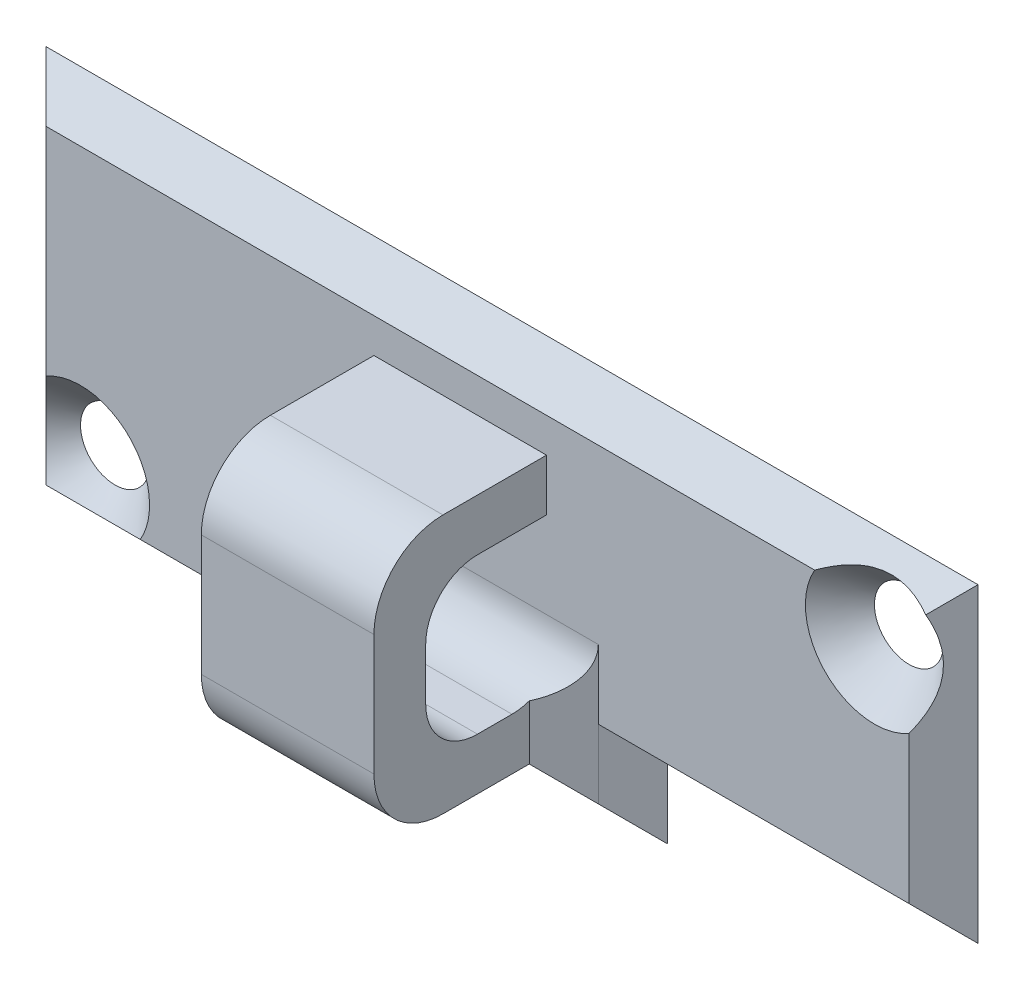
ISO-10303-21;
HEADER;
FILE_DESCRIPTION(('STEP AP214'),'2;1');
FILE_NAME('part.step','',(''),(''),'','','');
FILE_SCHEMA(('AUTOMOTIVE_DESIGN { 1 0 10303 214 1 1 1 1 }'));
ENDSEC;
DATA;
#1=APPLICATION_CONTEXT('core data for automotive mechanical design processes');
#2=APPLICATION_PROTOCOL_DEFINITION('international standard','automotive_design',2000,#1);
#3=PRODUCT_CONTEXT('',#1,'mechanical');
#4=PRODUCT('Part','Part','',(#3));
#5=PRODUCT_RELATED_PRODUCT_CATEGORY('part','',(#4));
#6=PRODUCT_DEFINITION_FORMATION('','',#4);
#7=PRODUCT_DEFINITION_CONTEXT('part definition',#1,'design');
#8=PRODUCT_DEFINITION('design','',#6,#7);
#9=PRODUCT_DEFINITION_SHAPE('','',#8);
#10=(LENGTH_UNIT() NAMED_UNIT(*) SI_UNIT(.MILLI.,.METRE.));
#11=(NAMED_UNIT(*) PLANE_ANGLE_UNIT() SI_UNIT($,.RADIAN.));
#12=(NAMED_UNIT(*) SI_UNIT($,.STERADIAN.) SOLID_ANGLE_UNIT());
#13=UNCERTAINTY_MEASURE_WITH_UNIT(LENGTH_MEASURE(1.E-05),#10,'distance_accuracy_value','');
#14=(GEOMETRIC_REPRESENTATION_CONTEXT(3) GLOBAL_UNCERTAINTY_ASSIGNED_CONTEXT((#13)) GLOBAL_UNIT_ASSIGNED_CONTEXT((#10,
#11,#12)) REPRESENTATION_CONTEXT('',''));
#15=CARTESIAN_POINT('',(0.,0.,0.));
#16=DIRECTION('',(0.,0.,1.));
#17=DIRECTION('',(1.,0.,0.));
#18=AXIS2_PLACEMENT_3D('',#15,#16,#17);
#19=CARTESIAN_POINT('',(0.,0.,1.));
#20=DIRECTION('',(0.,0.,1.));
#21=DIRECTION('',(1.,0.,0.));
#22=AXIS2_PLACEMENT_3D('',#19,#20,#21);
#23=PLANE('',#22);
#24=DIRECTION('',(0.,1.,0.));
#25=VECTOR('',#24,1.);
#26=CARTESIAN_POINT('',(-3.5,-0.5,1.));
#27=LINE('',#26,#25);
#28=CARTESIAN_POINT('',(-3.5,-4.5,1.));
#29=VERTEX_POINT('',#28);
#30=CARTESIAN_POINT('',(-3.5,-0.5,1.));
#31=VERTEX_POINT('',#30);
#32=EDGE_CURVE('E224',#29,#31,#27,.T.);
#33=ORIENTED_EDGE('',*,*,#32,.T.);
#34=DIRECTION('',(1.,0.,0.));
#35=VECTOR('',#34,1.);
#36=CARTESIAN_POINT('',(2.5,-0.5,1.));
#37=LINE('',#36,#35);
#38=CARTESIAN_POINT('',(3.5,-0.5,1.));
#39=VERTEX_POINT('',#38);
#40=EDGE_CURVE('E425',#31,#39,#37,.T.);
#41=ORIENTED_EDGE('',*,*,#40,.T.);
#42=DIRECTION('',(0.,-1.,0.));
#43=VECTOR('',#42,1.);
#44=CARTESIAN_POINT('',(3.5,0.,1.));
#45=LINE('',#44,#43);
#46=CARTESIAN_POINT('',(3.5,-2.5,1.));
#47=VERTEX_POINT('',#46);
#48=EDGE_CURVE('E410',#39,#47,#45,.T.);
#49=ORIENTED_EDGE('',*,*,#48,.T.);
#50=DIRECTION('',(1.,0.,0.));
#51=VECTOR('',#50,1.);
#52=CARTESIAN_POINT('',(13.5,-2.5,1.));
#53=LINE('',#52,#51);
#54=CARTESIAN_POINT('',(12.5,-2.5,1.));
#55=VERTEX_POINT('',#54);
#56=EDGE_CURVE('E412',#47,#55,#53,.T.);
#57=ORIENTED_EDGE('',*,*,#56,.T.);
#58=DIRECTION('',(0.,1.,0.));
#59=VECTOR('',#58,1.);
#60=CARTESIAN_POINT('',(12.5,5.5,1.));
#61=LINE('',#60,#59);
#62=CARTESIAN_POINT('',(12.5,1.76794919243112,1.));
#63=VERTEX_POINT('',#62);
#64=EDGE_CURVE('E414',#55,#63,#61,.T.);
#65=ORIENTED_EDGE('',*,*,#64,.T.);
#66=CARTESIAN_POINT('',(11.5,3.5,1.));
#67=DIRECTION('',(0.,0.,1.));
#68=DIRECTION('',(1.,0.,0.));
#69=AXIS2_PLACEMENT_3D('',#66,#67,#68);
#70=CIRCLE('',#69,2.);
#71=CARTESIAN_POINT('',(9.76794919243112,4.5,1.));
#72=VERTEX_POINT('',#71);
#73=EDGE_CURVE('E416',#63,#72,#70,.F.);
#74=ORIENTED_EDGE('',*,*,#73,.T.);
#75=DIRECTION('',(-1.,0.,0.));
#76=VECTOR('',#75,1.);
#77=CARTESIAN_POINT('',(0.,4.5,1.));
#78=LINE('',#77,#76);
#79=CARTESIAN_POINT('',(-12.5,4.5,1.));
#80=VERTEX_POINT('',#79);
#81=EDGE_CURVE('E418',#72,#80,#78,.T.);
#82=ORIENTED_EDGE('',*,*,#81,.T.);
#83=DIRECTION('',(0.,-1.,0.));
#84=VECTOR('',#83,1.);
#85=CARTESIAN_POINT('',(-12.5,0.,1.));
#86=LINE('',#85,#84);
#87=CARTESIAN_POINT('',(-12.5,-1.76794919243112,1.));
#88=VERTEX_POINT('',#87);
#89=EDGE_CURVE('E420',#80,#88,#86,.T.);
#90=ORIENTED_EDGE('',*,*,#89,.T.);
#91=CARTESIAN_POINT('',(-11.5,-3.5,1.));
#92=DIRECTION('',(0.,0.,1.));
#93=DIRECTION('',(1.,0.,0.));
#94=AXIS2_PLACEMENT_3D('',#91,#92,#93);
#95=CIRCLE('',#94,2.);
#96=CARTESIAN_POINT('',(-9.76794919243112,-4.5,1.));
#97=VERTEX_POINT('',#96);
#98=EDGE_CURVE('E422',#88,#97,#95,.F.);
#99=ORIENTED_EDGE('',*,*,#98,.T.);
#100=DIRECTION('',(1.,0.,0.));
#101=VECTOR('',#100,1.);
#102=CARTESIAN_POINT('',(4.5,-4.5,1.));
#103=LINE('',#102,#101);
#104=EDGE_CURVE('E424',#97,#29,#103,.T.);
#105=ORIENTED_EDGE('',*,*,#104,.T.);
#106=EDGE_LOOP('',(#33,#41,#49,#57,#65,#74,#82,#90,#99,#105));
#107=FACE_BOUND('',#106,.T.);
#108=ADVANCED_FACE('F41',(#107),#23,.T.);
#109=CARTESIAN_POINT('',(0.,0.,0.));
#110=DIRECTION('',(0.,0.,1.));
#111=DIRECTION('',(1.,0.,0.));
#112=AXIS2_PLACEMENT_3D('',#109,#110,#111);
#113=PLANE('',#112);
#114=CARTESIAN_POINT('',(11.5,3.5,0.));
#115=DIRECTION('',(0.,0.,1.));
#116=DIRECTION('',(1.,0.,0.));
#117=AXIS2_PLACEMENT_3D('',#114,#115,#116);
#118=CIRCLE('',#117,1.);
#119=CARTESIAN_POINT('',(12.5,3.5,0.));
#120=VERTEX_POINT('',#119);
#121=EDGE_CURVE('E472',#120,#120,#118,.T.);
#122=ORIENTED_EDGE('',*,*,#121,.T.);
#123=EDGE_LOOP('',(#122));
#124=FACE_BOUND('',#123,.T.);
#125=CARTESIAN_POINT('',(-11.5,-3.5,0.));
#126=DIRECTION('',(0.,0.,1.));
#127=DIRECTION('',(1.,0.,0.));
#128=AXIS2_PLACEMENT_3D('',#125,#126,#127);
#129=CIRCLE('',#128,1.);
#130=CARTESIAN_POINT('',(-10.5,-3.5,0.));
#131=VERTEX_POINT('',#130);
#132=EDGE_CURVE('E476',#131,#131,#129,.T.);
#133=ORIENTED_EDGE('',*,*,#132,.T.);
#134=EDGE_LOOP('',(#133));
#135=FACE_BOUND('',#134,.T.);
#136=DIRECTION('',(0.,-1.,0.));
#137=VECTOR('',#136,1.);
#138=CARTESIAN_POINT('',(4.5,0.,0.));
#139=LINE('',#138,#137);
#140=CARTESIAN_POINT('',(4.5,-3.5,0.));
#141=VERTEX_POINT('',#140);
#142=CARTESIAN_POINT('',(4.5,-5.5,0.));
#143=VERTEX_POINT('',#142);
#144=EDGE_CURVE('E479',#141,#143,#139,.T.);
#145=ORIENTED_EDGE('',*,*,#144,.T.);
#146=DIRECTION('',(1.,0.,0.));
#147=VECTOR('',#146,1.);
#148=CARTESIAN_POINT('',(0.,-5.5,0.));
#149=LINE('',#148,#147);
#150=CARTESIAN_POINT('',(-13.5,-5.5,0.));
#151=VERTEX_POINT('',#150);
#152=EDGE_CURVE('E491',#151,#143,#149,.T.);
#153=ORIENTED_EDGE('',*,*,#152,.F.);
#154=DIRECTION('',(0.,1.,0.));
#155=VECTOR('',#154,1.);
#156=CARTESIAN_POINT('',(-13.5,0.,0.));
#157=LINE('',#156,#155);
#158=CARTESIAN_POINT('',(-13.5,5.5,0.));
#159=VERTEX_POINT('',#158);
#160=EDGE_CURVE('E489',#151,#159,#157,.T.);
#161=ORIENTED_EDGE('',*,*,#160,.T.);
#162=DIRECTION('',(1.,0.,0.));
#163=VECTOR('',#162,1.);
#164=CARTESIAN_POINT('',(0.,5.5,0.));
#165=LINE('',#164,#163);
#166=CARTESIAN_POINT('',(13.5,5.5,0.));
#167=VERTEX_POINT('',#166);
#168=EDGE_CURVE('E487',#159,#167,#165,.T.);
#169=ORIENTED_EDGE('',*,*,#168,.T.);
#170=DIRECTION('',(0.,1.,0.));
#171=VECTOR('',#170,1.);
#172=CARTESIAN_POINT('',(13.5,0.,0.));
#173=LINE('',#172,#171);
#174=CARTESIAN_POINT('',(13.5,-3.5,0.));
#175=VERTEX_POINT('',#174);
#176=EDGE_CURVE('E484',#175,#167,#173,.T.);
#177=ORIENTED_EDGE('',*,*,#176,.F.);
#178=DIRECTION('',(1.,0.,0.));
#179=VECTOR('',#178,1.);
#180=CARTESIAN_POINT('',(0.,-3.5,0.));
#181=LINE('',#180,#179);
#182=EDGE_CURVE('E481',#141,#175,#181,.T.);
#183=ORIENTED_EDGE('',*,*,#182,.F.);
#184=EDGE_LOOP('',(#145,#153,#161,#169,#177,#183));
#185=FACE_BOUND('',#184,.T.);
#186=ADVANCED_FACE('F364',(#124,#135,#185),#113,.F.);
#187=CARTESIAN_POINT('',(-2.5,-3.5,1.));
#188=DIRECTION('',(0.,-1.,0.));
#189=DIRECTION('',(0.,0.,-1.));
#190=AXIS2_PLACEMENT_3D('',#187,#188,#189);
#191=PLANE('',#190);
#192=DIRECTION('',(0.,0.,-1.));
#193=VECTOR('',#192,1.);
#194=CARTESIAN_POINT('',(-2.5,-3.5,1.));
#195=LINE('',#194,#193);
#196=CARTESIAN_POINT('',(-2.5,-3.5,4.5));
#197=VERTEX_POINT('',#196);
#198=CARTESIAN_POINT('',(-2.5,-3.5,2.00000000000001));
#199=VERTEX_POINT('',#198);
#200=EDGE_CURVE('E215',#197,#199,#195,.T.);
#201=ORIENTED_EDGE('',*,*,#200,.T.);
#202=DIRECTION('',(1.,0.,0.));
#203=VECTOR('',#202,1.);
#204=CARTESIAN_POINT('',(2.5,-3.5,2.00000000000001));
#205=LINE('',#204,#203);
#206=CARTESIAN_POINT('',(2.5,-3.5,2.00000000000001));
#207=VERTEX_POINT('',#206);
#208=EDGE_CURVE('E223',#199,#207,#205,.T.);
#209=ORIENTED_EDGE('',*,*,#208,.T.);
#210=DIRECTION('',(0.,0.,-1.));
#211=VECTOR('',#210,1.);
#212=CARTESIAN_POINT('',(2.5,-3.5,1.));
#213=LINE('',#212,#211);
#214=CARTESIAN_POINT('',(2.5,-3.5,4.5));
#215=VERTEX_POINT('',#214);
#216=EDGE_CURVE('E461',#215,#207,#213,.T.);
#217=ORIENTED_EDGE('',*,*,#216,.F.);
#218=DIRECTION('',(1.,0.,0.));
#219=VECTOR('',#218,1.);
#220=CARTESIAN_POINT('',(-2.5,-3.5,4.5));
#221=LINE('',#220,#219);
#222=EDGE_CURVE('E231',#215,#197,#221,.F.);
#223=ORIENTED_EDGE('',*,*,#222,.T.);
#224=EDGE_LOOP('',(#201,#209,#217,#223));
#225=FACE_BOUND('',#224,.T.);
#226=ADVANCED_FACE('F227',(#225),#191,.T.);
#227=CARTESIAN_POINT('',(-2.5,-3.5,6.5));
#228=DIRECTION('',(0.,0.,1.));
#229=DIRECTION('',(1.,0.,0.));
#230=AXIS2_PLACEMENT_3D('',#227,#228,#229);
#231=PLANE('',#230);
#232=DIRECTION('',(0.,-1.,0.));
#233=VECTOR('',#232,1.);
#234=CARTESIAN_POINT('',(2.5,-3.5,6.5));
#235=LINE('',#234,#233);
#236=CARTESIAN_POINT('',(2.5,2.,6.5));
#237=VERTEX_POINT('',#236);
#238=CARTESIAN_POINT('',(2.5,-1.5,6.5));
#239=VERTEX_POINT('',#238);
#240=EDGE_CURVE('E458',#237,#239,#235,.T.);
#241=ORIENTED_EDGE('',*,*,#240,.F.);
#242=DIRECTION('',(1.,0.,0.));
#243=VECTOR('',#242,1.);
#244=CARTESIAN_POINT('',(-2.5,2.,6.5));
#245=LINE('',#244,#243);
#246=CARTESIAN_POINT('',(-2.5,2.,6.5));
#247=VERTEX_POINT('',#246);
#248=EDGE_CURVE('E403',#237,#247,#245,.F.);
#249=ORIENTED_EDGE('',*,*,#248,.T.);
#250=DIRECTION('',(0.,-1.,0.));
#251=VECTOR('',#250,1.);
#252=CARTESIAN_POINT('',(-2.5,-3.5,6.5));
#253=LINE('',#252,#251);
#254=CARTESIAN_POINT('',(-2.5,-1.5,6.5));
#255=VERTEX_POINT('',#254);
#256=EDGE_CURVE('E233',#247,#255,#253,.T.);
#257=ORIENTED_EDGE('',*,*,#256,.T.);
#258=DIRECTION('',(1.,0.,0.));
#259=VECTOR('',#258,1.);
#260=CARTESIAN_POINT('',(-2.5,-1.5,6.5));
#261=LINE('',#260,#259);
#262=EDGE_CURVE('E399',#255,#239,#261,.T.);
#263=ORIENTED_EDGE('',*,*,#262,.T.);
#264=EDGE_LOOP('',(#241,#249,#257,#263));
#265=FACE_BOUND('',#264,.T.);
#266=ADVANCED_FACE('F457',(#265),#231,.T.);
#267=CARTESIAN_POINT('',(-2.5,4.,1.5));
#268=DIRECTION('',(0.,1.,0.));
#269=DIRECTION('',(0.,0.,1.));
#270=AXIS2_PLACEMENT_3D('',#267,#268,#269);
#271=PLANE('',#270);
#272=DIRECTION('',(0.,0.,1.));
#273=VECTOR('',#272,1.);
#274=CARTESIAN_POINT('',(-2.5,4.,1.5));
#275=LINE('',#274,#273);
#276=CARTESIAN_POINT('',(-2.5,4.,1.5));
#277=VERTEX_POINT('',#276);
#278=CARTESIAN_POINT('',(-2.5,4.,4.5));
#279=VERTEX_POINT('',#278);
#280=EDGE_CURVE('E519',#277,#279,#275,.T.);
#281=ORIENTED_EDGE('',*,*,#280,.T.);
#282=DIRECTION('',(1.,0.,0.));
#283=VECTOR('',#282,1.);
#284=CARTESIAN_POINT('',(-2.5,4.,4.5));
#285=LINE('',#284,#283);
#286=CARTESIAN_POINT('',(2.5,4.,4.5));
#287=VERTEX_POINT('',#286);
#288=EDGE_CURVE('E448',#279,#287,#285,.T.);
#289=ORIENTED_EDGE('',*,*,#288,.T.);
#290=DIRECTION('',(0.,0.,1.));
#291=VECTOR('',#290,1.);
#292=CARTESIAN_POINT('',(2.5,4.,1.5));
#293=LINE('',#292,#291);
#294=CARTESIAN_POINT('',(2.5,4.,1.5));
#295=VERTEX_POINT('',#294);
#296=EDGE_CURVE('E462',#295,#287,#293,.T.);
#297=ORIENTED_EDGE('',*,*,#296,.F.);
#298=DIRECTION('',(1.,0.,0.));
#299=VECTOR('',#298,1.);
#300=CARTESIAN_POINT('',(-2.5,4.,1.5));
#301=LINE('',#300,#299);
#302=EDGE_CURVE('E470',#277,#295,#301,.T.);
#303=ORIENTED_EDGE('',*,*,#302,.F.);
#304=EDGE_LOOP('',(#281,#289,#297,#303));
#305=FACE_BOUND('',#304,.T.);
#306=ADVANCED_FACE('F536',(#305),#271,.T.);
#307=CARTESIAN_POINT('',(-2.5,2.5,1.5));
#308=DIRECTION('',(0.,0.,-1.));
#309=DIRECTION('',(-1.,0.,0.));
#310=AXIS2_PLACEMENT_3D('',#307,#308,#309);
#311=PLANE('',#310);
#312=DIRECTION('',(0.,1.,0.));
#313=VECTOR('',#312,1.);
#314=CARTESIAN_POINT('',(2.5,2.5,1.5));
#315=LINE('',#314,#313);
#316=CARTESIAN_POINT('',(2.5,2.5,1.5));
#317=VERTEX_POINT('',#316);
#318=EDGE_CURVE('E466',#317,#295,#315,.T.);
#319=ORIENTED_EDGE('',*,*,#318,.F.);
#320=DIRECTION('',(1.,0.,0.));
#321=VECTOR('',#320,1.);
#322=CARTESIAN_POINT('',(-2.5,2.5,1.5));
#323=LINE('',#322,#321);
#324=CARTESIAN_POINT('',(-2.5,2.5,1.5));
#325=VERTEX_POINT('',#324);
#326=EDGE_CURVE('E232',#325,#317,#323,.T.);
#327=ORIENTED_EDGE('',*,*,#326,.F.);
#328=DIRECTION('',(0.,1.,0.));
#329=VECTOR('',#328,1.);
#330=CARTESIAN_POINT('',(-2.5,2.5,1.5));
#331=LINE('',#330,#329);
#332=EDGE_CURVE('E516',#325,#277,#331,.T.);
#333=ORIENTED_EDGE('',*,*,#332,.T.);
#334=ORIENTED_EDGE('',*,*,#302,.T.);
#335=EDGE_LOOP('',(#319,#327,#333,#334));
#336=FACE_BOUND('',#335,.T.);
#337=ADVANCED_FACE('F531',(#336),#311,.T.);
#338=CARTESIAN_POINT('',(-2.5,2.5,5.));
#339=DIRECTION('',(0.,-1.,0.));
#340=DIRECTION('',(0.,0.,-1.));
#341=AXIS2_PLACEMENT_3D('',#338,#339,#340);
#342=PLANE('',#341);
#343=DIRECTION('',(0.,0.,-1.));
#344=VECTOR('',#343,1.);
#345=CARTESIAN_POINT('',(2.5,2.5,5.));
#346=LINE('',#345,#344);
#347=CARTESIAN_POINT('',(2.5,2.5,3.5));
#348=VERTEX_POINT('',#347);
#349=EDGE_CURVE('E96',#348,#317,#346,.T.);
#350=ORIENTED_EDGE('',*,*,#349,.F.);
#351=DIRECTION('',(1.,0.,0.));
#352=VECTOR('',#351,1.);
#353=CARTESIAN_POINT('',(-2.5,2.5,3.5));
#354=LINE('',#353,#352);
#355=CARTESIAN_POINT('',(-2.5,2.5,3.5));
#356=VERTEX_POINT('',#355);
#357=EDGE_CURVE('E499',#348,#356,#354,.F.);
#358=ORIENTED_EDGE('',*,*,#357,.T.);
#359=DIRECTION('',(0.,0.,-1.));
#360=VECTOR('',#359,1.);
#361=CARTESIAN_POINT('',(-2.5,2.5,5.));
#362=LINE('',#361,#360);
#363=EDGE_CURVE('E511',#356,#325,#362,.T.);
#364=ORIENTED_EDGE('',*,*,#363,.T.);
#365=ORIENTED_EDGE('',*,*,#326,.T.);
#366=EDGE_LOOP('',(#350,#358,#364,#365));
#367=FACE_BOUND('',#366,.T.);
#368=ADVANCED_FACE('F541',(#367),#342,.T.);
#369=CARTESIAN_POINT('',(-2.5,-2.,5.));
#370=DIRECTION('',(0.,0.,-1.));
#371=DIRECTION('',(-1.,0.,0.));
#372=AXIS2_PLACEMENT_3D('',#369,#370,#371);
#373=PLANE('',#372);
#374=DIRECTION('',(0.,1.,0.));
#375=VECTOR('',#374,1.);
#376=CARTESIAN_POINT('',(-2.5,-2.,5.));
#377=LINE('',#376,#375);
#378=CARTESIAN_POINT('',(-2.5,-0.5,5.));
#379=VERTEX_POINT('',#378);
#380=CARTESIAN_POINT('',(-2.5,1.,5.));
#381=VERTEX_POINT('',#380);
#382=EDGE_CURVE('E508',#379,#381,#377,.T.);
#383=ORIENTED_EDGE('',*,*,#382,.T.);
#384=DIRECTION('',(1.,0.,0.));
#385=VECTOR('',#384,1.);
#386=CARTESIAN_POINT('',(2.5,1.,5.));
#387=LINE('',#386,#385);
#388=CARTESIAN_POINT('',(2.5,1.,5.));
#389=VERTEX_POINT('',#388);
#390=EDGE_CURVE('E496',#381,#389,#387,.T.);
#391=ORIENTED_EDGE('',*,*,#390,.T.);
#392=DIRECTION('',(0.,1.,0.));
#393=VECTOR('',#392,1.);
#394=CARTESIAN_POINT('',(2.5,-2.,5.));
#395=LINE('',#394,#393);
#396=CARTESIAN_POINT('',(2.5,-0.5,5.));
#397=VERTEX_POINT('',#396);
#398=EDGE_CURVE('E524',#397,#389,#395,.T.);
#399=ORIENTED_EDGE('',*,*,#398,.F.);
#400=DIRECTION('',(1.,0.,0.));
#401=VECTOR('',#400,1.);
#402=CARTESIAN_POINT('',(-2.5,-0.5,5.));
#403=LINE('',#402,#401);
#404=EDGE_CURVE('E494',#397,#379,#403,.F.);
#405=ORIENTED_EDGE('',*,*,#404,.T.);
#406=EDGE_LOOP('',(#383,#391,#399,#405));
#407=FACE_BOUND('',#406,.T.);
#408=ADVANCED_FACE('F547',(#407),#373,.T.);
#409=CARTESIAN_POINT('',(-2.5,-2.,1.));
#410=DIRECTION('',(0.,1.,0.));
#411=DIRECTION('',(0.,0.,1.));
#412=AXIS2_PLACEMENT_3D('',#409,#410,#411);
#413=PLANE('',#412);
#414=DIRECTION('',(0.,0.,1.));
#415=VECTOR('',#414,1.);
#416=CARTESIAN_POINT('',(-2.5,-2.,1.));
#417=LINE('',#416,#415);
#418=CARTESIAN_POINT('',(-2.5,-2.,2.5));
#419=VERTEX_POINT('',#418);
#420=CARTESIAN_POINT('',(-2.5,-2.,3.5));
#421=VERTEX_POINT('',#420);
#422=EDGE_CURVE('E464',#419,#421,#417,.T.);
#423=ORIENTED_EDGE('',*,*,#422,.T.);
#424=DIRECTION('',(1.,0.,0.));
#425=VECTOR('',#424,1.);
#426=CARTESIAN_POINT('',(2.5,-2.,3.5));
#427=LINE('',#426,#425);
#428=CARTESIAN_POINT('',(2.5,-2.,3.5));
#429=VERTEX_POINT('',#428);
#430=EDGE_CURVE('E431',#421,#429,#427,.T.);
#431=ORIENTED_EDGE('',*,*,#430,.T.);
#432=DIRECTION('',(0.,0.,1.));
#433=VECTOR('',#432,1.);
#434=CARTESIAN_POINT('',(2.5,-2.,1.));
#435=LINE('',#434,#433);
#436=CARTESIAN_POINT('',(2.5,-2.,2.5));
#437=VERTEX_POINT('',#436);
#438=EDGE_CURVE('E505',#437,#429,#435,.T.);
#439=ORIENTED_EDGE('',*,*,#438,.F.);
#440=DIRECTION('',(1.,0.,0.));
#441=VECTOR('',#440,1.);
#442=CARTESIAN_POINT('',(-2.5,-2.,2.5));
#443=LINE('',#442,#441);
#444=EDGE_CURVE('E436',#437,#419,#443,.F.);
#445=ORIENTED_EDGE('',*,*,#444,.T.);
#446=EDGE_LOOP('',(#423,#431,#439,#445));
#447=FACE_BOUND('',#446,.T.);
#448=ADVANCED_FACE('F373',(#447),#413,.T.);
#449=CARTESIAN_POINT('',(-2.5,0.,0.));
#450=DIRECTION('',(-1.,0.,0.));
#451=DIRECTION('',(0.,0.,1.));
#452=AXIS2_PLACEMENT_3D('',#449,#450,#451);
#453=PLANE('',#452);
#454=CARTESIAN_POINT('',(-2.5,-0.5,2.5));
#455=DIRECTION('',(-1.,0.,0.));
#456=DIRECTION('',(0.,0.,1.));
#457=AXIS2_PLACEMENT_3D('',#454,#455,#456);
#458=CIRCLE('',#457,1.5);
#459=CARTESIAN_POINT('',(-2.5,-1.9142135623731,2.00000000000001));
#460=VERTEX_POINT('',#459);
#461=EDGE_CURVE('E219',#419,#460,#458,.F.);
#462=ORIENTED_EDGE('',*,*,#461,.T.);
#463=DIRECTION('',(0.,-1.,0.));
#464=VECTOR('',#463,1.);
#465=CARTESIAN_POINT('',(-2.5,-3.5,2.00000000000001));
#466=LINE('',#465,#464);
#467=EDGE_CURVE('E212',#460,#199,#466,.T.);
#468=ORIENTED_EDGE('',*,*,#467,.T.);
#469=ORIENTED_EDGE('',*,*,#200,.F.);
#470=CARTESIAN_POINT('',(-2.5,-1.5,4.5));
#471=DIRECTION('',(-1.,0.,0.));
#472=DIRECTION('',(0.,0.,1.));
#473=AXIS2_PLACEMENT_3D('',#470,#471,#472);
#474=CIRCLE('',#473,2.);
#475=EDGE_CURVE('E397',#197,#255,#474,.T.);
#476=ORIENTED_EDGE('',*,*,#475,.T.);
#477=ORIENTED_EDGE('',*,*,#256,.F.);
#478=CARTESIAN_POINT('',(-2.5,2.,4.5));
#479=DIRECTION('',(-1.,0.,0.));
#480=DIRECTION('',(0.,0.,1.));
#481=AXIS2_PLACEMENT_3D('',#478,#479,#480);
#482=CIRCLE('',#481,2.);
#483=EDGE_CURVE('E402',#247,#279,#482,.T.);
#484=ORIENTED_EDGE('',*,*,#483,.T.);
#485=ORIENTED_EDGE('',*,*,#280,.F.);
#486=ORIENTED_EDGE('',*,*,#332,.F.);
#487=ORIENTED_EDGE('',*,*,#363,.F.);
#488=CARTESIAN_POINT('',(-2.5,1.,3.5));
#489=DIRECTION('',(-1.,0.,0.));
#490=DIRECTION('',(0.,0.,1.));
#491=AXIS2_PLACEMENT_3D('',#488,#489,#490);
#492=CIRCLE('',#491,1.5);
#493=EDGE_CURVE('E433',#356,#381,#492,.F.);
#494=ORIENTED_EDGE('',*,*,#493,.T.);
#495=ORIENTED_EDGE('',*,*,#382,.F.);
#496=CARTESIAN_POINT('',(-2.5,-0.5,3.5));
#497=DIRECTION('',(-1.,0.,0.));
#498=DIRECTION('',(0.,0.,1.));
#499=AXIS2_PLACEMENT_3D('',#496,#497,#498);
#500=CIRCLE('',#499,1.5);
#501=EDGE_CURVE('E443',#379,#421,#500,.F.);
#502=ORIENTED_EDGE('',*,*,#501,.T.);
#503=ORIENTED_EDGE('',*,*,#422,.F.);
#504=EDGE_LOOP('',(#462,#468,#469,#476,#477,#484,#485,#486,#487,#494,#495,#502,#503));
#505=FACE_BOUND('',#504,.T.);
#506=ADVANCED_FACE('F214',(#505),#453,.T.);
#507=CARTESIAN_POINT('',(2.5,0.,0.));
#508=DIRECTION('',(-1.,0.,0.));
#509=DIRECTION('',(0.,0.,1.));
#510=AXIS2_PLACEMENT_3D('',#507,#508,#509);
#511=PLANE('',#510);
#512=ORIENTED_EDGE('',*,*,#216,.T.);
#513=DIRECTION('',(0.,1.,0.));
#514=VECTOR('',#513,1.);
#515=CARTESIAN_POINT('',(2.5,0.,2.00000000000001));
#516=LINE('',#515,#514);
#517=CARTESIAN_POINT('',(2.5,-1.9142135623731,2.00000000000001));
#518=VERTEX_POINT('',#517);
#519=EDGE_CURVE('E66',#207,#518,#516,.T.);
#520=ORIENTED_EDGE('',*,*,#519,.T.);
#521=CARTESIAN_POINT('',(2.5,-0.5,2.5));
#522=DIRECTION('',(-1.,0.,0.));
#523=DIRECTION('',(0.,0.,1.));
#524=AXIS2_PLACEMENT_3D('',#521,#522,#523);
#525=CIRCLE('',#524,1.5);
#526=EDGE_CURVE('E445',#518,#437,#525,.T.);
#527=ORIENTED_EDGE('',*,*,#526,.T.);
#528=ORIENTED_EDGE('',*,*,#438,.T.);
#529=CARTESIAN_POINT('',(2.5,-0.5,3.5));
#530=DIRECTION('',(-1.,0.,0.));
#531=DIRECTION('',(0.,0.,1.));
#532=AXIS2_PLACEMENT_3D('',#529,#530,#531);
#533=CIRCLE('',#532,1.5);
#534=EDGE_CURVE('E441',#429,#397,#533,.T.);
#535=ORIENTED_EDGE('',*,*,#534,.T.);
#536=ORIENTED_EDGE('',*,*,#398,.T.);
#537=CARTESIAN_POINT('',(2.5,1.,3.5));
#538=DIRECTION('',(-1.,0.,0.));
#539=DIRECTION('',(0.,0.,1.));
#540=AXIS2_PLACEMENT_3D('',#537,#538,#539);
#541=CIRCLE('',#540,1.5);
#542=EDGE_CURVE('E430',#389,#348,#541,.T.);
#543=ORIENTED_EDGE('',*,*,#542,.T.);
#544=ORIENTED_EDGE('',*,*,#349,.T.);
#545=ORIENTED_EDGE('',*,*,#318,.T.);
#546=ORIENTED_EDGE('',*,*,#296,.T.);
#547=CARTESIAN_POINT('',(2.5,2.,4.5));
#548=DIRECTION('',(-1.,0.,0.));
#549=DIRECTION('',(0.,0.,1.));
#550=AXIS2_PLACEMENT_3D('',#547,#548,#549);
#551=CIRCLE('',#550,2.);
#552=EDGE_CURVE('E453',#287,#237,#551,.F.);
#553=ORIENTED_EDGE('',*,*,#552,.T.);
#554=ORIENTED_EDGE('',*,*,#240,.T.);
#555=CARTESIAN_POINT('',(2.5,-1.5,4.5));
#556=DIRECTION('',(-1.,0.,0.));
#557=DIRECTION('',(0.,0.,1.));
#558=AXIS2_PLACEMENT_3D('',#555,#556,#557);
#559=CIRCLE('',#558,2.);
#560=EDGE_CURVE('E451',#239,#215,#559,.F.);
#561=ORIENTED_EDGE('',*,*,#560,.T.);
#562=EDGE_LOOP('',(#512,#520,#527,#528,#535,#536,#543,#544,#545,#546,#553,#554,#561));
#563=FACE_BOUND('',#562,.T.);
#564=ADVANCED_FACE('F380',(#563),#511,.F.);
#565=CARTESIAN_POINT('',(-2.5,1.,3.5));
#566=DIRECTION('',(-1.,0.,0.));
#567=DIRECTION('',(0.,0.,1.));
#568=AXIS2_PLACEMENT_3D('',#565,#566,#567);
#569=CYLINDRICAL_SURFACE('',#568,1.5);
#570=ORIENTED_EDGE('',*,*,#493,.F.);
#571=ORIENTED_EDGE('',*,*,#357,.F.);
#572=ORIENTED_EDGE('',*,*,#542,.F.);
#573=ORIENTED_EDGE('',*,*,#390,.F.);
#574=EDGE_LOOP('',(#570,#571,#572,#573));
#575=FACE_BOUND('',#574,.T.);
#576=ADVANCED_FACE('F376',(#575),#569,.F.);
#577=CARTESIAN_POINT('',(-2.5,-0.5,3.5));
#578=DIRECTION('',(-1.,0.,0.));
#579=DIRECTION('',(0.,0.,1.));
#580=AXIS2_PLACEMENT_3D('',#577,#578,#579);
#581=CYLINDRICAL_SURFACE('',#580,1.5);
#582=ORIENTED_EDGE('',*,*,#501,.F.);
#583=ORIENTED_EDGE('',*,*,#404,.F.);
#584=ORIENTED_EDGE('',*,*,#534,.F.);
#585=ORIENTED_EDGE('',*,*,#430,.F.);
#586=EDGE_LOOP('',(#582,#583,#584,#585));
#587=FACE_BOUND('',#586,.T.);
#588=ADVANCED_FACE('F379',(#587),#581,.F.);
#589=CARTESIAN_POINT('',(0.,-0.5,2.5));
#590=DIRECTION('',(-1.,0.,0.));
#591=DIRECTION('',(0.,0.,1.));
#592=AXIS2_PLACEMENT_3D('',#589,#590,#591);
#593=CYLINDRICAL_SURFACE('',#592,1.5);
#594=ORIENTED_EDGE('',*,*,#461,.F.);
#595=ORIENTED_EDGE('',*,*,#444,.F.);
#596=ORIENTED_EDGE('',*,*,#526,.F.);
#597=CARTESIAN_POINT('',(2.00000000000002,-0.5,2.5));
#598=DIRECTION('',(-0.707106781186551,0.,-0.707106781186544));
#599=DIRECTION('',(-0.707106781186544,0.,0.707106781186551));
#600=AXIS2_PLACEMENT_3D('',#597,#598,#599);
#601=ELLIPSE('',#600,2.12132034355963,1.5);
#602=EDGE_CURVE('E12',#518,#39,#601,.F.);
#603=ORIENTED_EDGE('',*,*,#602,.T.);
#604=ORIENTED_EDGE('',*,*,#40,.F.);
#605=CARTESIAN_POINT('',(-2.00000000000002,-0.5,2.5));
#606=DIRECTION('',(-0.707106781186551,0.,0.707106781186544));
#607=DIRECTION('',(-0.707106781186544,0.,-0.707106781186551));
#608=AXIS2_PLACEMENT_3D('',#605,#606,#607);
#609=ELLIPSE('',#608,2.12132034355963,1.5);
#610=EDGE_CURVE('E57',#31,#460,#609,.T.);
#611=ORIENTED_EDGE('',*,*,#610,.T.);
#612=EDGE_LOOP('',(#594,#595,#596,#603,#604,#611));
#613=FACE_BOUND('',#612,.T.);
#614=ADVANCED_FACE('F384',(#613),#593,.F.);
#615=CARTESIAN_POINT('',(-2.5,2.,4.5));
#616=DIRECTION('',(1.,0.,0.));
#617=DIRECTION('',(0.,0.,-1.));
#618=AXIS2_PLACEMENT_3D('',#615,#616,#617);
#619=CYLINDRICAL_SURFACE('',#618,2.);
#620=ORIENTED_EDGE('',*,*,#483,.F.);
#621=ORIENTED_EDGE('',*,*,#248,.F.);
#622=ORIENTED_EDGE('',*,*,#552,.F.);
#623=ORIENTED_EDGE('',*,*,#288,.F.);
#624=EDGE_LOOP('',(#620,#621,#622,#623));
#625=FACE_BOUND('',#624,.T.);
#626=ADVANCED_FACE('F388',(#625),#619,.T.);
#627=CARTESIAN_POINT('',(-2.5,-1.5,4.5));
#628=DIRECTION('',(1.,0.,0.));
#629=DIRECTION('',(0.,0.,-1.));
#630=AXIS2_PLACEMENT_3D('',#627,#628,#629);
#631=CYLINDRICAL_SURFACE('',#630,2.);
#632=ORIENTED_EDGE('',*,*,#475,.F.);
#633=ORIENTED_EDGE('',*,*,#222,.F.);
#634=ORIENTED_EDGE('',*,*,#560,.F.);
#635=ORIENTED_EDGE('',*,*,#262,.F.);
#636=EDGE_LOOP('',(#632,#633,#634,#635));
#637=FACE_BOUND('',#636,.T.);
#638=ADVANCED_FACE('F342',(#637),#631,.T.);
#639=CARTESIAN_POINT('',(11.5,3.5,0.));
#640=DIRECTION('',(0.,0.,1.));
#641=DIRECTION('',(1.,0.,0.));
#642=AXIS2_PLACEMENT_3D('',#639,#640,#641);
#643=CONICAL_SURFACE('',#642,1.,0.78539816339745);
#644=ORIENTED_EDGE('',*,*,#121,.F.);
#645=EDGE_LOOP('',(#644));
#646=FACE_BOUND('',#645,.T.);
#647=CARTESIAN_POINT('',(9.7676028169037,4.4998,1.0002));
#648=CARTESIAN_POINT('',(9.80575931725496,4.52183239683999,0.978167603160007));
#649=CARTESIAN_POINT('',(9.84441657928379,4.54342936479459,0.956570635205409));
#650=CARTESIAN_POINT('',(9.92276471209283,4.58564423485238,0.914355765147619));
#651=CARTESIAN_POINT('',(9.96245523791513,4.60626245738314,0.893737542616855));
#652=CARTESIAN_POINT('',(10.0835252284365,4.6666889917118,0.833311008288192));
#653=CARTESIAN_POINT('',(10.1665605672992,4.70486902755063,0.795130972449365));
#654=CARTESIAN_POINT('',(10.3383118597862,4.77632595187072,0.723674048129274));
#655=CARTESIAN_POINT('',(10.4270898813901,4.80952880043666,0.690471199563333));
#656=CARTESIAN_POINT('',(10.6091572357907,4.86911075224095,0.630889247759046));
#657=CARTESIAN_POINT('',(10.7024446506498,4.89549272674838,0.604507273251612));
#658=CARTESIAN_POINT('',(10.856793471597,4.93163191544428,0.568368084555712));
#659=CARTESIAN_POINT('',(10.916689364417,4.94390219174345,0.556097808256542));
#660=CARTESIAN_POINT('',(11.037679015249,4.96498568470554,0.535014315294461));
#661=CARTESIAN_POINT('',(11.0987723637726,4.97380006223424,0.526199937765759));
#662=CARTESIAN_POINT('',(11.221336339942,4.98767894116802,0.512321058831976));
#663=CARTESIAN_POINT('',(11.2828006402674,4.9927712416482,0.507228758351797));
#664=CARTESIAN_POINT('',(11.4061230962642,4.99916472154999,0.50083527845001));
#665=CARTESIAN_POINT('',(11.4679812346279,5.00046606643168,0.499533933568321));
#666=CARTESIAN_POINT('',(11.5916924619814,4.99923718817388,0.500762811826119));
#667=CARTESIAN_POINT('',(11.6535454621713,4.99670252625265,0.503297473747343));
#668=CARTESIAN_POINT('',(11.7767102441151,4.98787080935526,0.51212919064474));
#669=CARTESIAN_POINT('',(11.8380220005879,4.98157357956658,0.518426420433422));
#670=CARTESIAN_POINT('',(11.9601453564803,4.96533717742257,0.534662822577426));
#671=CARTESIAN_POINT('',(12.0209497318744,4.95537098464533,0.544629015354667));
#672=CARTESIAN_POINT('',(12.1412633669618,4.93206740832792,0.56793259167208));
#673=CARTESIAN_POINT('',(12.2007721186887,4.91872872751875,0.581271272481249));
#674=CARTESIAN_POINT('',(12.3491370845198,4.88116557413134,0.618834425868656));
#675=CARTESIAN_POINT('',(12.4369692555043,4.8549053051813,0.645094694818699));
#676=CARTESIAN_POINT('',(12.6085716631412,4.79640822609221,0.703591773907785));
#677=CARTESIAN_POINT('',(12.692338589812,4.76416664556535,0.735833354434645));
#678=CARTESIAN_POINT('',(12.8545275438532,4.69528954243942,0.80471045756058));
#679=CARTESIAN_POINT('',(12.9330087823716,4.65872328169087,0.841276718309128));
#680=CARTESIAN_POINT('',(13.0476085130994,4.60105977962446,0.898940220375537));
#681=CARTESIAN_POINT('',(13.0852124935991,4.58141369792714,0.918586302072855));
#682=CARTESIAN_POINT('',(13.1594941608326,4.54124286252354,0.958757137476457));
#683=CARTESIAN_POINT('',(13.1961714761555,4.52071776511622,0.979282234883779));
#684=CARTESIAN_POINT('',(13.2323971830963,4.4998,1.0002));
#685=B_SPLINE_CURVE_WITH_KNOTS('',3,(#647,#648,#649,#650,#651,#652,#653,#654,#655,#656,#657,
#658,#659,#660,#661,#662,#663,#664,#665,#666,#667,#668,#669,#670,#671,#672,#673,#674,#675,#676,
#677,#678,#679,#680,#681,#682,#683,#684),.UNSPECIFIED.,.F.,.F.,(4,2,2,2,2,2,2,2,2,2,2,2,2,2,2,2,
2,2,4),(0.,0.147774430479984,0.29550014322285,0.59228146530864,0.893113760301669,
1.1938192120152,1.38071945762115,1.56755686794674,1.75298417488962,1.93840338854933,
2.12403732157087,2.30967987999353,2.49671790130439,2.68382797884134,2.96933637511724,
3.25507346491463,3.53673336332195,3.67697661577721,3.81727521409137),.UNSPECIFIED.);
#686=CARTESIAN_POINT('',(12.7426406871193,4.74264068711928,0.757359312880712));
#687=VERTEX_POINT('',#686);
#688=EDGE_CURVE('E323',#72,#687,#685,.T.);
#689=ORIENTED_EDGE('',*,*,#688,.F.);
#690=ORIENTED_EDGE('',*,*,#73,.F.);
#691=CARTESIAN_POINT('',(12.4998,5.23239718309631,1.0002));
#692=CARTESIAN_POINT('',(12.52183239684,5.19424068274504,0.978167603160008));
#693=CARTESIAN_POINT('',(12.5434293647946,5.15558342071621,0.956570635205409));
#694=CARTESIAN_POINT('',(12.5856442348524,5.07723528790718,0.91435576514762));
#695=CARTESIAN_POINT('',(12.6062624573831,5.03754476208487,0.893737542616856));
#696=CARTESIAN_POINT('',(12.6666889917118,4.91647477156355,0.833311008288193));
#697=CARTESIAN_POINT('',(12.7048690275506,4.83343943270076,0.795130972449365));
#698=CARTESIAN_POINT('',(12.7763259518707,4.66168814021379,0.723674048129274));
#699=CARTESIAN_POINT('',(12.8095288004367,4.57291011860988,0.690471199563333));
#700=CARTESIAN_POINT('',(12.8691107522409,4.3908427642093,0.630889247759046));
#701=CARTESIAN_POINT('',(12.8954927267484,4.29755534935022,0.604507273251612));
#702=CARTESIAN_POINT('',(12.9316319154443,4.143206528403,0.568368084555712));
#703=CARTESIAN_POINT('',(12.9439021917435,4.083310635583,0.556097808256542));
#704=CARTESIAN_POINT('',(12.9649856847055,3.96232098475097,0.535014315294461));
#705=CARTESIAN_POINT('',(12.9738000622342,3.90122763622743,0.526199937765758));
#706=CARTESIAN_POINT('',(12.987678941168,3.77866366005802,0.512321058831976));
#707=CARTESIAN_POINT('',(12.9927712416482,3.71719935973255,0.507228758351796));
#708=CARTESIAN_POINT('',(12.99916472155,3.59387690373582,0.500835278450009));
#709=CARTESIAN_POINT('',(13.0004660664317,3.53201876537212,0.49953393356832));
#710=CARTESIAN_POINT('',(12.9992371881739,3.40830753801863,0.500762811826118));
#711=CARTESIAN_POINT('',(12.9967025262527,3.34645453782868,0.503297473747342));
#712=CARTESIAN_POINT('',(12.9878708093553,3.22328975588488,0.512129190644739));
#713=CARTESIAN_POINT('',(12.9815735795666,3.16197799941205,0.51842642043342));
#714=CARTESIAN_POINT('',(12.9653371774226,3.03985464351969,0.534662822577425));
#715=CARTESIAN_POINT('',(12.9553709846453,2.97905026812563,0.544629015354665));
#716=CARTESIAN_POINT('',(12.9320674083279,2.85873663303818,0.567932591672079));
#717=CARTESIAN_POINT('',(12.9187287275187,2.79922788131133,0.581271272481248));
#718=CARTESIAN_POINT('',(12.8811655741313,2.65086291548025,0.618834425868655));
#719=CARTESIAN_POINT('',(12.8549053051813,2.56303074449575,0.645094694818698));
#720=CARTESIAN_POINT('',(12.7964082260922,2.39142833685878,0.703591773907784));
#721=CARTESIAN_POINT('',(12.7641666455653,2.30766141018799,0.735833354434644));
#722=CARTESIAN_POINT('',(12.6952895424394,2.14547245614685,0.804710457560579));
#723=CARTESIAN_POINT('',(12.6587232816909,2.06699121762838,0.841276718309128));
#724=CARTESIAN_POINT('',(12.6010597796245,1.95239148690058,0.898940220375537));
#725=CARTESIAN_POINT('',(12.5814136979271,1.91478750640085,0.918586302072855));
#726=CARTESIAN_POINT('',(12.5412428625235,1.84050583916739,0.958757137476457));
#727=CARTESIAN_POINT('',(12.5207177651162,1.80382852384447,0.97928223488378));
#728=CARTESIAN_POINT('',(12.4998,1.76760281690369,1.0002));
#729=B_SPLINE_CURVE_WITH_KNOTS('',3,(#691,#692,#693,#694,#695,#696,#697,#698,#699,#700,#701,
#702,#703,#704,#705,#706,#707,#708,#709,#710,#711,#712,#713,#714,#715,#716,#717,#718,#719,#720,
#721,#722,#723,#724,#725,#726,#727,#728),.UNSPECIFIED.,.F.,.F.,(4,2,2,2,2,2,2,2,2,2,2,2,2,2,2,2,
2,2,4),(0.,0.147774430479984,0.295500143222851,0.592281465308641,0.893113760301669,
1.1938192120152,1.38071945762116,1.56755686794674,1.75298417488962,1.93840338854933,
2.12403732157087,2.30967987999353,2.49671790130439,2.68382797884134,2.96933637511724,
3.25507346491463,3.53673336332196,3.67697661577721,3.81727521409138),.UNSPECIFIED.);
#730=EDGE_CURVE('E46',#687,#63,#729,.T.);
#731=ORIENTED_EDGE('',*,*,#730,.F.);
#732=EDGE_LOOP('',(#689,#690,#731));
#733=FACE_BOUND('',#732,.T.);
#734=ADVANCED_FACE('F335',(#646,#733),#643,.F.);
#735=CARTESIAN_POINT('',(12.5,0.,1.));
#736=DIRECTION('',(0.707106781186546,0.,0.707106781186549));
#737=DIRECTION('',(0.,-1.,0.));
#738=AXIS2_PLACEMENT_3D('',#735,#736,#737);
#739=PLANE('',#738);
#740=DIRECTION('',(-0.577350269189626,0.577350269189626,0.577350269189624));
#741=VECTOR('',#740,1.);
#742=CARTESIAN_POINT('',(8.33333333333332,1.66666666666668,5.16666666666666));
#743=LINE('',#742,#741);
#744=EDGE_CURVE('E320',#175,#55,#743,.T.);
#745=ORIENTED_EDGE('',*,*,#744,.F.);
#746=ORIENTED_EDGE('',*,*,#176,.T.);
#747=DIRECTION('',(0.577350269189626,0.577350269189626,-0.577350269189624));
#748=VECTOR('',#747,1.);
#749=CARTESIAN_POINT('',(11.,2.99999999999999,2.5));
#750=LINE('',#749,#748);
#751=EDGE_CURVE('E330',#687,#167,#750,.T.);
#752=ORIENTED_EDGE('',*,*,#751,.F.);
#753=ORIENTED_EDGE('',*,*,#730,.T.);
#754=ORIENTED_EDGE('',*,*,#64,.F.);
#755=EDGE_LOOP('',(#745,#746,#752,#753,#754));
#756=FACE_BOUND('',#755,.T.);
#757=ADVANCED_FACE('F44',(#756),#739,.T.);
#758=CARTESIAN_POINT('',(0.,5.5,0.));
#759=DIRECTION('',(0.,-0.707106781186546,-0.707106781186549));
#760=DIRECTION('',(1.,0.,0.));
#761=AXIS2_PLACEMENT_3D('',#758,#759,#760);
#762=PLANE('',#761);
#763=ORIENTED_EDGE('',*,*,#751,.T.);
#764=ORIENTED_EDGE('',*,*,#168,.F.);
#765=DIRECTION('',(0.577350269189626,-0.577350269189626,0.577350269189624));
#766=VECTOR('',#765,1.);
#767=CARTESIAN_POINT('',(-8.99999999999999,0.999999999999989,4.49999999999999));
#768=LINE('',#767,#766);
#769=EDGE_CURVE('E316',#80,#159,#768,.F.);
#770=ORIENTED_EDGE('',*,*,#769,.F.);
#771=ORIENTED_EDGE('',*,*,#81,.F.);
#772=ORIENTED_EDGE('',*,*,#688,.T.);
#773=EDGE_LOOP('',(#763,#764,#770,#771,#772));
#774=FACE_BOUND('',#773,.T.);
#775=ADVANCED_FACE('F344',(#774),#762,.F.);
#776=CARTESIAN_POINT('',(-3.5,0.,1.));
#777=DIRECTION('',(-0.707106781186551,0.,0.707106781186544));
#778=DIRECTION('',(0.,-1.,0.));
#779=AXIS2_PLACEMENT_3D('',#776,#777,#778);
#780=PLANE('',#779);
#781=ORIENTED_EDGE('',*,*,#610,.F.);
#782=ORIENTED_EDGE('',*,*,#32,.F.);
#783=DIRECTION('',(-0.577350269189624,-0.577350269189624,-0.57735026918963));
#784=VECTOR('',#783,1.);
#785=CARTESIAN_POINT('',(-2.5,-3.5,2.00000000000001));
#786=LINE('',#785,#784);
#787=EDGE_CURVE('E237',#199,#29,#786,.T.);
#788=ORIENTED_EDGE('',*,*,#787,.F.);
#789=ORIENTED_EDGE('',*,*,#467,.F.);
#790=EDGE_LOOP('',(#781,#782,#788,#789));
#791=FACE_BOUND('',#790,.T.);
#792=ADVANCED_FACE('F238',(#791),#780,.T.);
#793=CARTESIAN_POINT('',(2.5,0.,2.00000000000001));
#794=DIRECTION('',(-0.707106781186551,0.,-0.707106781186544));
#795=DIRECTION('',(0.,1.,0.));
#796=AXIS2_PLACEMENT_3D('',#793,#794,#795);
#797=PLANE('',#796);
#798=ORIENTED_EDGE('',*,*,#602,.F.);
#799=ORIENTED_EDGE('',*,*,#519,.F.);
#800=DIRECTION('',(-0.577350269189624,0.577350269189624,0.57735026918963));
#801=VECTOR('',#800,1.);
#802=CARTESIAN_POINT('',(1.33333333333334,-2.33333333333334,3.16666666666668));
#803=LINE('',#802,#801);
#804=CARTESIAN_POINT('',(3.5,-4.5,1.));
#805=VERTEX_POINT('',#804);
#806=EDGE_CURVE('E243',#805,#207,#803,.T.);
#807=ORIENTED_EDGE('',*,*,#806,.F.);
#808=DIRECTION('',(0.,-1.,0.));
#809=VECTOR('',#808,1.);
#810=CARTESIAN_POINT('',(3.5,0.,1.));
#811=LINE('',#810,#809);
#812=EDGE_CURVE('E552',#47,#805,#811,.T.);
#813=ORIENTED_EDGE('',*,*,#812,.F.);
#814=ORIENTED_EDGE('',*,*,#48,.F.);
#815=EDGE_LOOP('',(#798,#799,#807,#813,#814));
#816=FACE_BOUND('',#815,.T.);
#817=ADVANCED_FACE('F360',(#816),#797,.F.);
#818=CARTESIAN_POINT('',(0.,-2.5,1.));
#819=DIRECTION('',(0.,-0.707106781186546,0.707106781186549));
#820=DIRECTION('',(-1.,0.,0.));
#821=AXIS2_PLACEMENT_3D('',#818,#819,#820);
#822=PLANE('',#821);
#823=ORIENTED_EDGE('',*,*,#744,.T.);
#824=ORIENTED_EDGE('',*,*,#56,.F.);
#825=DIRECTION('',(0.577350269189626,-0.577350269189626,-0.577350269189624));
#826=VECTOR('',#825,1.);
#827=CARTESIAN_POINT('',(2.33333333333333,-1.33333333333333,2.16666666666666));
#828=LINE('',#827,#826);
#829=EDGE_CURVE('E558',#141,#47,#828,.F.);
#830=ORIENTED_EDGE('',*,*,#829,.F.);
#831=ORIENTED_EDGE('',*,*,#182,.T.);
#832=EDGE_LOOP('',(#823,#824,#830,#831));
#833=FACE_BOUND('',#832,.T.);
#834=ADVANCED_FACE('F306',(#833),#822,.T.);
#835=CARTESIAN_POINT('',(-13.5,0.,0.));
#836=DIRECTION('',(0.707106781186546,0.,-0.707106781186549));
#837=DIRECTION('',(0.,1.,0.));
#838=AXIS2_PLACEMENT_3D('',#835,#836,#837);
#839=PLANE('',#838);
#840=CARTESIAN_POINT('',(-12.4998,-5.23239718309631,1.0002));
#841=CARTESIAN_POINT('',(-12.52183239684,-5.19424068274504,0.978167603160008));
#842=CARTESIAN_POINT('',(-12.5434293647946,-5.15558342071621,0.956570635205409));
#843=CARTESIAN_POINT('',(-12.5856442348524,-5.07723528790718,0.91435576514762));
#844=CARTESIAN_POINT('',(-12.6062624573831,-5.03754476208487,0.893737542616856));
#845=CARTESIAN_POINT('',(-12.6666889917118,-4.91647477156355,0.833311008288193));
#846=CARTESIAN_POINT('',(-12.7048690275506,-4.83343943270077,0.795130972449366));
#847=CARTESIAN_POINT('',(-12.7763259518707,-4.66168814021379,0.723674048129274));
#848=CARTESIAN_POINT('',(-12.8095288004367,-4.57291011860988,0.690471199563333));
#849=CARTESIAN_POINT('',(-12.869110752241,-4.3908427642093,0.630889247759047));
#850=CARTESIAN_POINT('',(-12.8954927267484,-4.29755534935022,0.604507273251612));
#851=CARTESIAN_POINT('',(-12.9316319154443,-4.143206528403,0.568368084555712));
#852=CARTESIAN_POINT('',(-12.9439021917435,-4.083310635583,0.556097808256542));
#853=CARTESIAN_POINT('',(-12.9649856847055,-3.96232098475097,0.535014315294461));
#854=CARTESIAN_POINT('',(-12.9738000622342,-3.90122763622743,0.526199937765759));
#855=CARTESIAN_POINT('',(-12.987678941168,-3.77866366005802,0.512321058831976));
#856=CARTESIAN_POINT('',(-12.9927712416482,-3.71719935973255,0.507228758351796));
#857=CARTESIAN_POINT('',(-12.99916472155,-3.59387690373582,0.50083527845001));
#858=CARTESIAN_POINT('',(-13.0004660664317,-3.53201876537212,0.49953393356832));
#859=CARTESIAN_POINT('',(-12.9992371881739,-3.40830753801863,0.500762811826119));
#860=CARTESIAN_POINT('',(-12.9967025262527,-3.34645453782868,0.503297473747343));
#861=CARTESIAN_POINT('',(-12.9878708093553,-3.22328975588488,0.51212919064474));
#862=CARTESIAN_POINT('',(-12.9815735795666,-3.16197799941205,0.518426420433421));
#863=CARTESIAN_POINT('',(-12.9653371774226,-3.03985464351969,0.534662822577425));
#864=CARTESIAN_POINT('',(-12.9553709846453,-2.97905026812563,0.544629015354666));
#865=CARTESIAN_POINT('',(-12.9320674083279,-2.85873663303818,0.56793259167208));
#866=CARTESIAN_POINT('',(-12.9187287275187,-2.79922788131133,0.581271272481249));
#867=CARTESIAN_POINT('',(-12.8811655741313,-2.65086291548025,0.618834425868656));
#868=CARTESIAN_POINT('',(-12.8549053051813,-2.56303074449575,0.645094694818699));
#869=CARTESIAN_POINT('',(-12.7964082260922,-2.39142833685878,0.703591773907785));
#870=CARTESIAN_POINT('',(-12.7641666455654,-2.30766141018799,0.735833354434645));
#871=CARTESIAN_POINT('',(-12.6952895424394,-2.14547245614684,0.80471045756058));
#872=CARTESIAN_POINT('',(-12.6587232816909,-2.06699121762838,0.841276718309129));
#873=CARTESIAN_POINT('',(-12.6010597796245,-1.95239148690058,0.898940220375538));
#874=CARTESIAN_POINT('',(-12.5814136979271,-1.91478750640085,0.918586302072855));
#875=CARTESIAN_POINT('',(-12.5412428625235,-1.84050583916738,0.958757137476458));
#876=CARTESIAN_POINT('',(-12.5207177651162,-1.80382852384447,0.97928223488378));
#877=CARTESIAN_POINT('',(-12.4998,-1.76760281690369,1.0002));
#878=B_SPLINE_CURVE_WITH_KNOTS('',3,(#840,#841,#842,#843,#844,#845,#846,#847,#848,#849,#850,
#851,#852,#853,#854,#855,#856,#857,#858,#859,#860,#861,#862,#863,#864,#865,#866,#867,#868,#869,
#870,#871,#872,#873,#874,#875,#876,#877),.UNSPECIFIED.,.F.,.F.,(4,2,2,2,2,2,2,2,2,2,2,2,2,2,2,2,
2,2,4),(0.,0.147774430479983,0.295500143222849,0.592281465308641,0.89311376030167,
1.1938192120152,1.38071945762116,1.56755686794674,1.75298417488962,1.93840338854933,
2.12403732157087,2.30967987999353,2.49671790130439,2.68382797884135,2.96933637511725,
3.25507346491463,3.53673336332196,3.67697661577721,3.81727521409138),.UNSPECIFIED.);
#879=CARTESIAN_POINT('',(-12.7426406871193,-4.74264068711928,0.757359312880712));
#880=VERTEX_POINT('',#879);
#881=EDGE_CURVE('E81',#88,#880,#878,.F.);
#882=ORIENTED_EDGE('',*,*,#881,.F.);
#883=ORIENTED_EDGE('',*,*,#89,.F.);
#884=ORIENTED_EDGE('',*,*,#769,.T.);
#885=ORIENTED_EDGE('',*,*,#160,.F.);
#886=DIRECTION('',(-0.577350269189626,-0.577350269189626,-0.577350269189624));
#887=VECTOR('',#886,1.);
#888=CARTESIAN_POINT('',(-11.6666666666667,-3.66666666666666,1.83333333333333));
#889=LINE('',#888,#887);
#890=EDGE_CURVE('E266',#880,#151,#889,.T.);
#891=ORIENTED_EDGE('',*,*,#890,.F.);
#892=EDGE_LOOP('',(#882,#883,#884,#885,#891));
#893=FACE_BOUND('',#892,.T.);
#894=ADVANCED_FACE('F279',(#893),#839,.F.);
#895=CARTESIAN_POINT('',(-11.5,-3.5,0.));
#896=DIRECTION('',(0.,0.,1.));
#897=DIRECTION('',(1.,0.,0.));
#898=AXIS2_PLACEMENT_3D('',#895,#896,#897);
#899=CONICAL_SURFACE('',#898,1.,0.785398163397451);
#900=ORIENTED_EDGE('',*,*,#132,.F.);
#901=EDGE_LOOP('',(#900));
#902=FACE_BOUND('',#901,.T.);
#903=ORIENTED_EDGE('',*,*,#98,.F.);
#904=ORIENTED_EDGE('',*,*,#881,.T.);
#905=CARTESIAN_POINT('',(-9.7676028169037,-4.4998,1.0002));
#906=CARTESIAN_POINT('',(-9.80575931725496,-4.52183239683999,0.978167603160007));
#907=CARTESIAN_POINT('',(-9.84441657928379,-4.54342936479459,0.956570635205408));
#908=CARTESIAN_POINT('',(-9.92276471209283,-4.58564423485238,0.914355765147619));
#909=CARTESIAN_POINT('',(-9.96245523791513,-4.60626245738314,0.893737542616855));
#910=CARTESIAN_POINT('',(-10.0835252284365,-4.6666889917118,0.833311008288192));
#911=CARTESIAN_POINT('',(-10.1665605672992,-4.70486902755063,0.795130972449365));
#912=CARTESIAN_POINT('',(-10.3383118597862,-4.77632595187072,0.723674048129274));
#913=CARTESIAN_POINT('',(-10.4270898813901,-4.80952880043666,0.690471199563333));
#914=CARTESIAN_POINT('',(-10.6091572357907,-4.86911075224095,0.630889247759046));
#915=CARTESIAN_POINT('',(-10.7024446506498,-4.89549272674838,0.604507273251612));
#916=CARTESIAN_POINT('',(-10.856793471597,-4.93163191544429,0.568368084555712));
#917=CARTESIAN_POINT('',(-10.916689364417,-4.94390219174346,0.556097808256541));
#918=CARTESIAN_POINT('',(-11.037679015249,-4.96498568470554,0.535014315294461));
#919=CARTESIAN_POINT('',(-11.0987723637726,-4.97380006223424,0.526199937765758));
#920=CARTESIAN_POINT('',(-11.221336339942,-4.98767894116802,0.512321058831976));
#921=CARTESIAN_POINT('',(-11.2828006402674,-4.9927712416482,0.507228758351796));
#922=CARTESIAN_POINT('',(-11.4061230962642,-4.99916472154999,0.50083527845001));
#923=CARTESIAN_POINT('',(-11.4679812346279,-5.00046606643168,0.49953393356832));
#924=CARTESIAN_POINT('',(-11.5916924619814,-4.99923718817388,0.500762811826119));
#925=CARTESIAN_POINT('',(-11.6535454621713,-4.99670252625265,0.503297473747343));
#926=CARTESIAN_POINT('',(-11.7767102441151,-4.98787080935526,0.51212919064474));
#927=CARTESIAN_POINT('',(-11.838022000588,-4.98157357956658,0.518426420433421));
#928=CARTESIAN_POINT('',(-11.9601453564803,-4.96533717742257,0.534662822577426));
#929=CARTESIAN_POINT('',(-12.0209497318744,-4.95537098464533,0.544629015354667));
#930=CARTESIAN_POINT('',(-12.1412633669618,-4.93206740832792,0.56793259167208));
#931=CARTESIAN_POINT('',(-12.2007721186887,-4.91872872751875,0.581271272481249));
#932=CARTESIAN_POINT('',(-12.3491370845198,-4.88116557413134,0.618834425868656));
#933=CARTESIAN_POINT('',(-12.4369692555043,-4.8549053051813,0.645094694818699));
#934=CARTESIAN_POINT('',(-12.6085716631412,-4.79640822609221,0.703591773907785));
#935=CARTESIAN_POINT('',(-12.692338589812,-4.76416664556535,0.735833354434645));
#936=CARTESIAN_POINT('',(-12.8545275438532,-4.69528954243942,0.80471045756058));
#937=CARTESIAN_POINT('',(-12.9330087823716,-4.65872328169087,0.841276718309129));
#938=CARTESIAN_POINT('',(-13.0476085130994,-4.60105977962446,0.898940220375537));
#939=CARTESIAN_POINT('',(-13.0852124935991,-4.58141369792714,0.918586302072855));
#940=CARTESIAN_POINT('',(-13.1594941608326,-4.54124286252354,0.958757137476457));
#941=CARTESIAN_POINT('',(-13.1961714761555,-4.52071776511622,0.979282234883779));
#942=CARTESIAN_POINT('',(-13.2323971830963,-4.4998,1.0002));
#943=B_SPLINE_CURVE_WITH_KNOTS('',3,(#905,#906,#907,#908,#909,#910,#911,#912,#913,#914,#915,
#916,#917,#918,#919,#920,#921,#922,#923,#924,#925,#926,#927,#928,#929,#930,#931,#932,#933,#934,
#935,#936,#937,#938,#939,#940,#941,#942),.UNSPECIFIED.,.F.,.F.,(4,2,2,2,2,2,2,2,2,2,2,2,2,2,2,2,
2,2,4),(0.,0.147774430479984,0.29550014322285,0.59228146530864,0.893113760301669,
1.1938192120152,1.38071945762116,1.56755686794674,1.75298417488962,1.93840338854933,
2.12403732157087,2.30967987999353,2.49671790130439,2.68382797884135,2.96933637511725,
3.25507346491463,3.53673336332196,3.67697661577721,3.81727521409137),.UNSPECIFIED.);
#944=EDGE_CURVE('E257',#97,#880,#943,.T.);
#945=ORIENTED_EDGE('',*,*,#944,.F.);
#946=EDGE_LOOP('',(#903,#904,#945));
#947=FACE_BOUND('',#946,.T.);
#948=ADVANCED_FACE('F272',(#902,#947),#899,.F.);
#949=CARTESIAN_POINT('',(-2.5,-3.5,2.00000000000001));
#950=DIRECTION('',(0.,-0.707106781186551,0.707106781186544));
#951=DIRECTION('',(-1.,0.,0.));
#952=AXIS2_PLACEMENT_3D('',#949,#950,#951);
#953=PLANE('',#952);
#954=ORIENTED_EDGE('',*,*,#208,.F.);
#955=ORIENTED_EDGE('',*,*,#787,.T.);
#956=DIRECTION('',(-1.,0.,0.));
#957=VECTOR('',#956,1.);
#958=CARTESIAN_POINT('',(-2.5,-4.5,1.));
#959=LINE('',#958,#957);
#960=EDGE_CURVE('E255',#805,#29,#959,.T.);
#961=ORIENTED_EDGE('',*,*,#960,.F.);
#962=ORIENTED_EDGE('',*,*,#806,.T.);
#963=EDGE_LOOP('',(#954,#955,#961,#962));
#964=FACE_BOUND('',#963,.T.);
#965=ADVANCED_FACE('F246',(#964),#953,.T.);
#966=CARTESIAN_POINT('',(4.5,0.,0.));
#967=DIRECTION('',(-0.707106781186546,0.,-0.707106781186549));
#968=DIRECTION('',(0.,-1.,0.));
#969=AXIS2_PLACEMENT_3D('',#966,#967,#968);
#970=PLANE('',#969);
#971=ORIENTED_EDGE('',*,*,#829,.T.);
#972=ORIENTED_EDGE('',*,*,#812,.T.);
#973=DIRECTION('',(-0.577350269189626,0.577350269189626,0.577350269189624));
#974=VECTOR('',#973,1.);
#975=CARTESIAN_POINT('',(2.66666666666666,-3.66666666666666,1.83333333333333));
#976=LINE('',#975,#974);
#977=EDGE_CURVE('E252',#143,#805,#976,.T.);
#978=ORIENTED_EDGE('',*,*,#977,.F.);
#979=ORIENTED_EDGE('',*,*,#144,.F.);
#980=EDGE_LOOP('',(#971,#972,#978,#979));
#981=FACE_BOUND('',#980,.T.);
#982=ADVANCED_FACE('F287',(#981),#970,.F.);
#983=CARTESIAN_POINT('',(0.,-4.5,1.));
#984=DIRECTION('',(0.,-0.707106781186546,0.707106781186549));
#985=DIRECTION('',(-1.,0.,0.));
#986=AXIS2_PLACEMENT_3D('',#983,#984,#985);
#987=PLANE('',#986);
#988=ORIENTED_EDGE('',*,*,#890,.T.);
#989=ORIENTED_EDGE('',*,*,#152,.T.);
#990=ORIENTED_EDGE('',*,*,#977,.T.);
#991=ORIENTED_EDGE('',*,*,#960,.T.);
#992=ORIENTED_EDGE('',*,*,#104,.F.);
#993=ORIENTED_EDGE('',*,*,#944,.T.);
#994=EDGE_LOOP('',(#988,#989,#990,#991,#992,#993));
#995=FACE_BOUND('',#994,.T.);
#996=ADVANCED_FACE('F281',(#995),#987,.T.);
#997=CLOSED_SHELL('',(#108,#186,#226,#266,#306,#337,#368,#408,#448,#506,#564,#576,#588,#614,
#626,#638,#734,#757,#775,#792,#817,#834,#894,#948,#965,#982,#996));
#998=MANIFOLD_SOLID_BREP('B2',#997);
#999=ADVANCED_BREP_SHAPE_REPRESENTATION('',(#18,#998),#14);
#1000=SHAPE_DEFINITION_REPRESENTATION(#9,#999);
ENDSEC;
END-ISO-10303-21;
